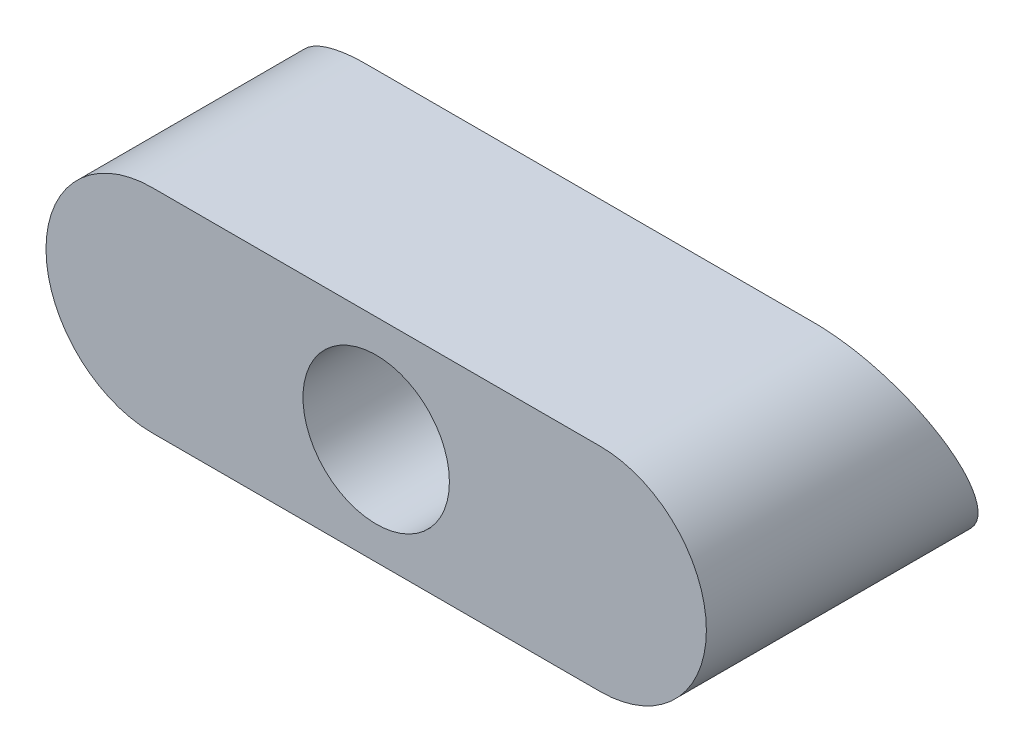
ISO-10303-21;
HEADER;
FILE_DESCRIPTION(('STEP AP214'),'2;1');
FILE_NAME('part.step','',(''),(''),'','','');
FILE_SCHEMA(('AUTOMOTIVE_DESIGN { 1 0 10303 214 1 1 1 1 }'));
ENDSEC;
DATA;
#1=APPLICATION_CONTEXT('core data for automotive mechanical design processes');
#2=APPLICATION_PROTOCOL_DEFINITION('international standard','automotive_design',2000,#1);
#3=PRODUCT_CONTEXT('',#1,'mechanical');
#4=PRODUCT('Part','Part','',(#3));
#5=PRODUCT_RELATED_PRODUCT_CATEGORY('part','',(#4));
#6=PRODUCT_DEFINITION_FORMATION('','',#4);
#7=PRODUCT_DEFINITION_CONTEXT('part definition',#1,'design');
#8=PRODUCT_DEFINITION('design','',#6,#7);
#9=PRODUCT_DEFINITION_SHAPE('','',#8);
#10=(LENGTH_UNIT() NAMED_UNIT(*) SI_UNIT(.MILLI.,.METRE.));
#11=(NAMED_UNIT(*) PLANE_ANGLE_UNIT() SI_UNIT($,.RADIAN.));
#12=(NAMED_UNIT(*) SI_UNIT($,.STERADIAN.) SOLID_ANGLE_UNIT());
#13=UNCERTAINTY_MEASURE_WITH_UNIT(LENGTH_MEASURE(1.E-05),#10,'distance_accuracy_value','');
#14=(GEOMETRIC_REPRESENTATION_CONTEXT(3) GLOBAL_UNCERTAINTY_ASSIGNED_CONTEXT((#13)) GLOBAL_UNIT_ASSIGNED_CONTEXT((#10,
#11,#12)) REPRESENTATION_CONTEXT('',''));
#15=CARTESIAN_POINT('',(0.,0.,0.));
#16=DIRECTION('',(0.,0.,1.));
#17=DIRECTION('',(1.,0.,0.));
#18=AXIS2_PLACEMENT_3D('',#15,#16,#17);
#19=CARTESIAN_POINT('',(7.8,136.1,168.291137873299));
#20=DIRECTION('',(0.,0.408679548619539,-0.912677942398155));
#21=DIRECTION('',(0.,0.912677942398155,0.408679548619539));
#22=AXIS2_PLACEMENT_3D('',#19,#20,#21);
#23=PLANE('',#22);
#24=CARTESIAN_POINT('',(7.8,136.1,168.291137873299));
#25=DIRECTION('',(0.,0.408679548619539,-0.912677942398155));
#26=DIRECTION('',(0.,0.912677942398155,0.408679548619539));
#27=AXIS2_PLACEMENT_3D('',#24,#25,#26);
#28=ELLIPSE('',#27,4.05400396801295,3.70000000000001);
#29=CARTESIAN_POINT('',(7.8,139.8,169.947926385048));
#30=VERTEX_POINT('',#29);
#31=CARTESIAN_POINT('',(7.80000000016695,132.4,166.634349361549));
#32=VERTEX_POINT('',#31);
#33=EDGE_CURVE('E563',#30,#32,#28,.T.);
#34=ORIENTED_EDGE('',*,*,#33,.T.);
#35=DIRECTION('',(-1.,0.,0.));
#36=VECTOR('',#35,1.);
#37=CARTESIAN_POINT('',(7.8,132.4,166.634349361549));
#38=LINE('',#37,#36);
#39=CARTESIAN_POINT('',(-7.80000000001584,132.4,166.634349361549));
#40=VERTEX_POINT('',#39);
#41=EDGE_CURVE('E593',#32,#40,#38,.T.);
#42=ORIENTED_EDGE('',*,*,#41,.T.);
#43=CARTESIAN_POINT('',(-7.8,136.1,168.291137873299));
#44=DIRECTION('',(0.,0.408679548619539,-0.912677942398155));
#45=DIRECTION('',(0.,0.912677942398155,0.408679548619539));
#46=AXIS2_PLACEMENT_3D('',#43,#44,#45);
#47=ELLIPSE('',#46,4.05400396801295,3.70000000000001);
#48=CARTESIAN_POINT('',(-7.8,139.8,169.947926385048));
#49=VERTEX_POINT('',#48);
#50=EDGE_CURVE('E442',#40,#49,#47,.T.);
#51=ORIENTED_EDGE('',*,*,#50,.T.);
#52=DIRECTION('',(1.,0.,0.));
#53=VECTOR('',#52,1.);
#54=CARTESIAN_POINT('',(-7.8,139.8,169.947926385048));
#55=LINE('',#54,#53);
#56=EDGE_CURVE('E13',#49,#30,#55,.T.);
#57=ORIENTED_EDGE('',*,*,#56,.T.);
#58=EDGE_LOOP('',(#34,#42,#51,#57));
#59=FACE_BOUND('',#58,.T.);
#60=ADVANCED_FACE('F432',(#59),#23,.T.);
#61=CARTESIAN_POINT('',(-7.8,136.1,177.4));
#62=DIRECTION('',(0.,0.,-1.));
#63=DIRECTION('',(-1.,0.,0.));
#64=AXIS2_PLACEMENT_3D('',#61,#62,#63);
#65=PLANE('',#64);
#66=CARTESIAN_POINT('',(0.,136.1,177.4));
#67=DIRECTION('',(0.,0.,1.));
#68=DIRECTION('',(1.,0.,0.));
#69=AXIS2_PLACEMENT_3D('',#66,#67,#68);
#70=CIRCLE('',#69,2.55);
#71=CARTESIAN_POINT('',(2.55,136.1,177.4));
#72=VERTEX_POINT('',#71);
#73=EDGE_CURVE('E623',#72,#72,#70,.T.);
#74=ORIENTED_EDGE('',*,*,#73,.F.);
#75=EDGE_LOOP('',(#74));
#76=FACE_BOUND('',#75,.T.);
#77=DIRECTION('',(-1.,0.,0.));
#78=VECTOR('',#77,1.);
#79=CARTESIAN_POINT('',(7.8,132.4,177.4));
#80=LINE('',#79,#78);
#81=CARTESIAN_POINT('',(7.8,132.4,177.4));
#82=VERTEX_POINT('',#81);
#83=CARTESIAN_POINT('',(-7.8,132.4,177.4));
#84=VERTEX_POINT('',#83);
#85=EDGE_CURVE('E478',#82,#84,#80,.T.);
#86=ORIENTED_EDGE('',*,*,#85,.F.);
#87=CARTESIAN_POINT('',(7.8,136.1,177.4));
#88=DIRECTION('',(0.,0.,-1.));
#89=DIRECTION('',(-1.,0.,0.));
#90=AXIS2_PLACEMENT_3D('',#87,#88,#89);
#91=CIRCLE('',#90,3.70000000000001);
#92=CARTESIAN_POINT('',(7.8,139.8,177.4));
#93=VERTEX_POINT('',#92);
#94=EDGE_CURVE('E490',#93,#82,#91,.T.);
#95=ORIENTED_EDGE('',*,*,#94,.F.);
#96=DIRECTION('',(1.,0.,0.));
#97=VECTOR('',#96,1.);
#98=CARTESIAN_POINT('',(-7.8,139.8,177.4));
#99=LINE('',#98,#97);
#100=CARTESIAN_POINT('',(-7.8,139.8,177.4));
#101=VERTEX_POINT('',#100);
#102=EDGE_CURVE('E481',#101,#93,#99,.T.);
#103=ORIENTED_EDGE('',*,*,#102,.F.);
#104=CARTESIAN_POINT('',(-7.8,136.1,177.4));
#105=DIRECTION('',(0.,0.,-1.));
#106=DIRECTION('',(-1.,0.,0.));
#107=AXIS2_PLACEMENT_3D('',#104,#105,#106);
#108=CIRCLE('',#107,3.70000000000001);
#109=EDGE_CURVE('E474',#84,#101,#108,.T.);
#110=ORIENTED_EDGE('',*,*,#109,.F.);
#111=EDGE_LOOP('',(#86,#95,#103,#110));
#112=FACE_BOUND('',#111,.T.);
#113=ADVANCED_FACE('F477',(#76,#112),#65,.F.);
#114=CARTESIAN_POINT('',(7.79999999716437,139.8,177.4));
#115=CARTESIAN_POINT('',(7.80001636775491,139.8,169.947926385048));
#116=CARTESIAN_POINT('',(8.29090080370105,139.8,177.4));
#117=CARTESIAN_POINT('',(8.30105497217331,139.8,169.947926385048));
#118=CARTESIAN_POINT('',(9.26713669198721,139.60242958635,177.4));
#119=CARTESIAN_POINT('',(9.30730780376014,139.591404129947,169.85452118475));
#120=CARTESIAN_POINT('',(10.4956603741717,138.772657200683,177.4));
#121=CARTESIAN_POINT('',(10.5404739554031,138.72694114081,169.467431360632));
#122=CARTESIAN_POINT('',(11.3101937960401,137.54322731209,177.4));
#123=CARTESIAN_POINT('',(11.322621550914,137.49980314702,168.917942676729));
#124=CARTESIAN_POINT('',(11.5950763319186,136.1,177.4));
#125=CARTESIAN_POINT('',(11.5887772972629,136.1,168.291137873299));
#126=CARTESIAN_POINT('',(11.3101937960401,134.656772687909,177.4));
#127=CARTESIAN_POINT('',(11.322621550914,134.700196852979,167.664333069868));
#128=CARTESIAN_POINT('',(10.4956603741717,133.427342799318,177.4));
#129=CARTESIAN_POINT('',(10.5404739554032,133.473058859191,167.114844385965));
#130=CARTESIAN_POINT('',(9.26713669198723,132.597570413649,177.4));
#131=CARTESIAN_POINT('',(9.30730780376011,132.608595870052,166.727754561847));
#132=CARTESIAN_POINT('',(8.29090080370105,132.4,177.4));
#133=CARTESIAN_POINT('',(8.30105497217331,132.4,166.634349361549));
#134=CARTESIAN_POINT('',(6.51314388037993,132.4,177.4));
#135=CARTESIAN_POINT('',(6.48658484705768,132.4,166.634349361549));
#136=CARTESIAN_POINT('',(3.92001395719914,132.4,177.4));
#137=CARTESIAN_POINT('',(3.88018130354982,132.4,166.634349361549));
#138=CARTESIAN_POINT('',(0.,132.4,177.4));
#139=CARTESIAN_POINT('',(0.,132.4,166.634349361549));
#140=CARTESIAN_POINT('',(-3.92001395719914,132.4,177.4));
#141=CARTESIAN_POINT('',(-3.88018130354982,132.4,166.634349361549));
#142=CARTESIAN_POINT('',(-6.51314388037993,132.4,177.4));
#143=CARTESIAN_POINT('',(-6.48658484705768,132.4,166.634349361549));
#144=CARTESIAN_POINT('',(-8.29090080370104,132.4,177.4));
#145=CARTESIAN_POINT('',(-8.30105497217331,132.4,166.634349361549));
#146=CARTESIAN_POINT('',(-9.26713669198722,132.597570413649,177.4));
#147=CARTESIAN_POINT('',(-9.30730780376011,132.608595870052,166.727754561847));
#148=CARTESIAN_POINT('',(-10.4956603741717,133.427342799318,177.4));
#149=CARTESIAN_POINT('',(-10.5404739554031,133.47305885919,167.114844385965));
#150=CARTESIAN_POINT('',(-11.3101937960401,134.656772687909,177.4));
#151=CARTESIAN_POINT('',(-11.322621550914,134.70019685298,167.664333069867));
#152=CARTESIAN_POINT('',(-11.5950763319186,136.1,177.4));
#153=CARTESIAN_POINT('',(-11.5887772972628,136.1,168.291137873299));
#154=CARTESIAN_POINT('',(-11.3101937960401,137.54322731209,177.4));
#155=CARTESIAN_POINT('',(-11.3226215509141,137.499803147021,168.917942676729));
#156=CARTESIAN_POINT('',(-10.4956603741717,138.772657200683,177.4));
#157=CARTESIAN_POINT('',(-10.5404739554031,138.726941140809,169.467431360632));
#158=CARTESIAN_POINT('',(-9.26713669198723,139.60242958635,177.4));
#159=CARTESIAN_POINT('',(-9.30730780376012,139.591404129947,169.85452118475));
#160=CARTESIAN_POINT('',(-8.29090080370105,139.8,177.4));
#161=CARTESIAN_POINT('',(-8.30105497217331,139.8,169.947926385048));
#162=CARTESIAN_POINT('',(-6.51314388037993,139.8,177.4));
#163=CARTESIAN_POINT('',(-6.48658484705768,139.8,169.947926385048));
#164=CARTESIAN_POINT('',(-3.92001395719914,139.8,177.4));
#165=CARTESIAN_POINT('',(-3.88018130354982,139.8,169.947926385048));
#166=CARTESIAN_POINT('',(0.,139.8,177.4));
#167=CARTESIAN_POINT('',(0.,139.8,169.947926385048));
#168=CARTESIAN_POINT('',(3.92001395719913,139.8,177.4));
#169=CARTESIAN_POINT('',(3.88018130354982,139.8,169.947926385048));
#170=CARTESIAN_POINT('',(6.51314388037993,139.8,177.4));
#171=CARTESIAN_POINT('',(6.48658484705768,139.8,169.947926385048));
#172=CARTESIAN_POINT('',(7.79999999716437,139.8,177.4));
#173=CARTESIAN_POINT('',(7.80001636775491,139.8,169.947926385048));
#174=B_SPLINE_SURFACE_WITH_KNOTS('',3,1,((#114,#115),(#116,#117),(#118,#119),(#120,#121),(#122,
#123),(#124,#125),(#126,#127),(#128,#129),(#130,#131),(#132,#133),(#134,#135),(#136,#137),(#138,
#139),(#140,#141),(#142,#143),(#144,#145),(#146,#147),(#148,#149),(#150,#151),(#152,#153),(#154,
#155),(#156,#157),(#158,#159),(#160,#161),(#162,#163),(#164,#165),(#166,#167),(#168,#169),(#170,
#171),(#172,#173)),.UNSPECIFIED.,.T.,.F.,.F.,(4,1,1,1,1,1,1,1,2,1,1,1,2,1,1,1,1,1,1,1,2,1,1,1,
4),(2,2),(0.,0.0270479764353572,0.0540959528707144,0.0811439293060716,0.108191905741429,
0.135239882176786,0.162287858612143,0.1893358350475,0.216383811482857,0.287287858612143,
0.358191905741429,0.429095952870714,0.5,0.527047976435357,0.554095952870714,0.581143929306072,
0.608191905741429,0.635239882176786,0.662287858612143,0.6893358350475,0.716383811482857,
0.787287858612143,0.858191905741429,0.929095952870714,1.),(0.,1.),.UNSPECIFIED.);
#175=ORIENTED_EDGE('',*,*,#94,.T.);
#176=ORIENTED_EDGE('',*,*,#85,.T.);
#177=ORIENTED_EDGE('',*,*,#109,.T.);
#178=ORIENTED_EDGE('',*,*,#102,.T.);
#179=EDGE_LOOP('',(#175,#176,#177,#178));
#180=FACE_BOUND('',#179,.T.);
#181=ORIENTED_EDGE('',*,*,#50,.F.);
#182=ORIENTED_EDGE('',*,*,#41,.F.);
#183=ORIENTED_EDGE('',*,*,#33,.F.);
#184=ORIENTED_EDGE('',*,*,#56,.F.);
#185=EDGE_LOOP('',(#181,#182,#183,#184));
#186=FACE_BOUND('',#185,.T.);
#187=ADVANCED_FACE('F489',(#180,#186),#174,.T.);
#188=CARTESIAN_POINT('',(0.,136.1,172.4));
#189=DIRECTION('',(0.,0.,1.));
#190=DIRECTION('',(1.,0.,0.));
#191=AXIS2_PLACEMENT_3D('',#188,#189,#190);
#192=CYLINDRICAL_SURFACE('',#191,2.55);
#193=CARTESIAN_POINT('',(0.,136.1,172.4));
#194=DIRECTION('',(0.,0.,1.));
#195=DIRECTION('',(1.,0.,0.));
#196=AXIS2_PLACEMENT_3D('',#193,#194,#195);
#197=CIRCLE('',#196,2.55);
#198=CARTESIAN_POINT('',(2.55,136.1,172.4));
#199=VERTEX_POINT('',#198);
#200=EDGE_CURVE('E492',#199,#199,#197,.T.);
#201=ORIENTED_EDGE('',*,*,#200,.F.);
#202=EDGE_LOOP('',(#201));
#203=FACE_BOUND('',#202,.T.);
#204=ORIENTED_EDGE('',*,*,#73,.T.);
#205=EDGE_LOOP('',(#204));
#206=FACE_BOUND('',#205,.T.);
#207=ADVANCED_FACE('F511',(#203,#206),#192,.F.);
#208=CARTESIAN_POINT('',(0.,136.1,172.4));
#209=DIRECTION('',(0.,0.,1.));
#210=DIRECTION('',(1.,0.,0.));
#211=AXIS2_PLACEMENT_3D('',#208,#209,#210);
#212=PLANE('',#211);
#213=ORIENTED_EDGE('',*,*,#200,.T.);
#214=EDGE_LOOP('',(#213));
#215=FACE_BOUND('',#214,.T.);
#216=ADVANCED_FACE('F630',(#215),#212,.T.);
#217=CLOSED_SHELL('',(#60,#113,#187,#207,#216));
#218=MANIFOLD_SOLID_BREP('B2',#217);
#219=ADVANCED_BREP_SHAPE_REPRESENTATION('',(#18,#218),#14);
#220=SHAPE_DEFINITION_REPRESENTATION(#9,#219);
ENDSEC;
END-ISO-10303-21;
